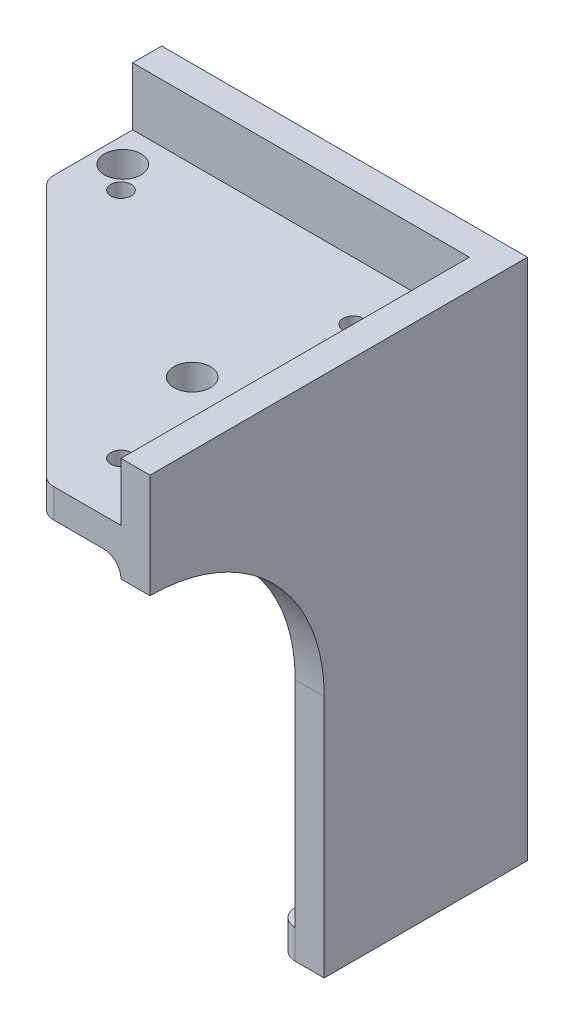
ISO-10303-21;
HEADER;
FILE_DESCRIPTION(('STEP AP214'),'2;1');
FILE_NAME('part.step','',(''),(''),'','','');
FILE_SCHEMA(('AUTOMOTIVE_DESIGN { 1 0 10303 214 1 1 1 1 }'));
ENDSEC;
DATA;
#1=APPLICATION_CONTEXT('core data for automotive mechanical design processes');
#2=APPLICATION_PROTOCOL_DEFINITION('international standard','automotive_design',2000,#1);
#3=PRODUCT_CONTEXT('',#1,'mechanical');
#4=PRODUCT('Part','Part','',(#3));
#5=PRODUCT_RELATED_PRODUCT_CATEGORY('part','',(#4));
#6=PRODUCT_DEFINITION_FORMATION('','',#4);
#7=PRODUCT_DEFINITION_CONTEXT('part definition',#1,'design');
#8=PRODUCT_DEFINITION('design','',#6,#7);
#9=PRODUCT_DEFINITION_SHAPE('','',#8);
#10=(LENGTH_UNIT() NAMED_UNIT(*) SI_UNIT(.MILLI.,.METRE.));
#11=(NAMED_UNIT(*) PLANE_ANGLE_UNIT() SI_UNIT($,.RADIAN.));
#12=(NAMED_UNIT(*) SI_UNIT($,.STERADIAN.) SOLID_ANGLE_UNIT());
#13=UNCERTAINTY_MEASURE_WITH_UNIT(LENGTH_MEASURE(1.E-05),#10,'distance_accuracy_value','');
#14=(GEOMETRIC_REPRESENTATION_CONTEXT(3) GLOBAL_UNCERTAINTY_ASSIGNED_CONTEXT((#13)) GLOBAL_UNIT_ASSIGNED_CONTEXT((#10,
#11,#12)) REPRESENTATION_CONTEXT('',''));
#15=CARTESIAN_POINT('',(0.,0.,0.));
#16=DIRECTION('',(0.,0.,1.));
#17=DIRECTION('',(1.,0.,0.));
#18=AXIS2_PLACEMENT_3D('',#15,#16,#17);
#19=CARTESIAN_POINT('',(-63.,-48.,5.));
#20=DIRECTION('',(0.,0.,1.));
#21=DIRECTION('',(1.,0.,0.));
#22=AXIS2_PLACEMENT_3D('',#19,#20,#21);
#23=PLANE('',#22);
#24=DIRECTION('',(0.,-1.,0.));
#25=VECTOR('',#24,1.);
#26=CARTESIAN_POINT('',(-7.99999999999996,-48.,5.));
#27=LINE('',#26,#25);
#28=CARTESIAN_POINT('',(-7.99999999999996,-85.,5.));
#29=VERTEX_POINT('',#28);
#30=CARTESIAN_POINT('',(-7.99999999999997,-18.,5.));
#31=VERTEX_POINT('',#30);
#32=EDGE_CURVE('E222',#29,#31,#27,.F.);
#33=ORIENTED_EDGE('',*,*,#32,.T.);
#34=DIRECTION('',(1.,0.,0.));
#35=VECTOR('',#34,1.);
#36=CARTESIAN_POINT('',(-63.,-18.,5.));
#37=LINE('',#36,#35);
#38=CARTESIAN_POINT('',(-63.,-18.,5.));
#39=VERTEX_POINT('',#38);
#40=EDGE_CURVE('E223',#31,#39,#37,.F.);
#41=ORIENTED_EDGE('',*,*,#40,.T.);
#42=CARTESIAN_POINT('',(-63.,-48.,5.));
#43=DIRECTION('',(0.,0.,-1.));
#44=DIRECTION('',(1.,0.,0.));
#45=AXIS2_PLACEMENT_3D('',#42,#43,#44);
#46=CIRCLE('',#45,30.);
#47=CARTESIAN_POINT('',(-33.,-48.,5.));
#48=VERTEX_POINT('',#47);
#49=EDGE_CURVE('E380',#39,#48,#46,.T.);
#50=ORIENTED_EDGE('',*,*,#49,.T.);
#51=DIRECTION('',(0.,-1.,0.));
#52=VECTOR('',#51,1.);
#53=CARTESIAN_POINT('',(-33.,-90.,5.));
#54=LINE('',#53,#52);
#55=CARTESIAN_POINT('',(-33.,-85.,5.));
#56=VERTEX_POINT('',#55);
#57=EDGE_CURVE('E382',#48,#56,#54,.T.);
#58=ORIENTED_EDGE('',*,*,#57,.T.);
#59=DIRECTION('',(1.,0.,0.));
#60=VECTOR('',#59,1.);
#61=CARTESIAN_POINT('',(-33.,-85.,5.));
#62=LINE('',#61,#60);
#63=EDGE_CURVE('E268',#56,#29,#62,.T.);
#64=ORIENTED_EDGE('',*,*,#63,.T.);
#65=EDGE_LOOP('',(#33,#41,#50,#58,#64));
#66=FACE_BOUND('',#65,.T.);
#67=ADVANCED_FACE('F33',(#66),#23,.T.);
#68=DIRECTION('',(0.,-1.,0.));
#69=VECTOR('',#68,1.);
#70=CARTESIAN_POINT('',(-63.,-18.,5.));
#71=LINE('',#70,#69);
#72=CARTESIAN_POINT('',(-63.,0.,5.));
#73=VERTEX_POINT('',#72);
#74=CARTESIAN_POINT('',(-63.,-10.,5.));
#75=VERTEX_POINT('',#74);
#76=EDGE_CURVE('E312',#73,#75,#71,.T.);
#77=ORIENTED_EDGE('',*,*,#76,.T.);
#78=DIRECTION('',(-1.,0.,0.));
#79=VECTOR('',#78,1.);
#80=CARTESIAN_POINT('',(-4.99999999999996,-10.,5.));
#81=LINE('',#80,#79);
#82=CARTESIAN_POINT('',(-4.99999999999996,-10.,5.));
#83=VERTEX_POINT('',#82);
#84=EDGE_CURVE('E251',#83,#75,#81,.T.);
#85=ORIENTED_EDGE('',*,*,#84,.F.);
#86=DIRECTION('',(0.,-1.,0.));
#87=VECTOR('',#86,1.);
#88=CARTESIAN_POINT('',(-4.99999999999997,0.,5.));
#89=LINE('',#88,#87);
#90=CARTESIAN_POINT('',(-4.99999999999996,0.,5.));
#91=VERTEX_POINT('',#90);
#92=EDGE_CURVE('E291',#91,#83,#89,.T.);
#93=ORIENTED_EDGE('',*,*,#92,.F.);
#94=DIRECTION('',(-1.,0.,0.));
#95=VECTOR('',#94,1.);
#96=CARTESIAN_POINT('',(-63.,0.,5.));
#97=LINE('',#96,#95);
#98=EDGE_CURVE('E318',#91,#73,#97,.T.);
#99=ORIENTED_EDGE('',*,*,#98,.T.);
#100=EDGE_LOOP('',(#77,#85,#93,#99));
#101=FACE_BOUND('',#100,.T.);
#102=ADVANCED_FACE('F376',(#101),#23,.T.);
#103=CARTESIAN_POINT('',(-4.99999999999997,0.,65.));
#104=DIRECTION('',(1.,0.,0.));
#105=DIRECTION('',(0.,1.,0.));
#106=AXIS2_PLACEMENT_3D('',#103,#104,#105);
#107=PLANE('',#106);
#108=CARTESIAN_POINT('',(-4.99999999999998,-48.,65.));
#109=DIRECTION('',(1.,0.,0.));
#110=DIRECTION('',(0.,1.,0.));
#111=AXIS2_PLACEMENT_3D('',#108,#109,#110);
#112=CIRCLE('',#111,30.);
#113=CARTESIAN_POINT('',(-4.99999999999998,-18.,65.));
#114=VERTEX_POINT('',#113);
#115=CARTESIAN_POINT('',(-4.99999999999997,-48.,35.));
#116=VERTEX_POINT('',#115);
#117=EDGE_CURVE('E288',#114,#116,#112,.F.);
#118=ORIENTED_EDGE('',*,*,#117,.F.);
#119=DIRECTION('',(0.,0.,-1.));
#120=VECTOR('',#119,1.);
#121=CARTESIAN_POINT('',(-4.99999999999997,-18.,5.));
#122=LINE('',#121,#120);
#123=CARTESIAN_POINT('',(-4.99999999999997,-18.,8.));
#124=VERTEX_POINT('',#123);
#125=EDGE_CURVE('E57',#114,#124,#122,.T.);
#126=ORIENTED_EDGE('',*,*,#125,.T.);
#127=DIRECTION('',(0.,-1.,0.));
#128=VECTOR('',#127,1.);
#129=CARTESIAN_POINT('',(-4.99999999999997,0.,8.));
#130=LINE('',#129,#128);
#131=CARTESIAN_POINT('',(-4.99999999999996,-85.,8.));
#132=VERTEX_POINT('',#131);
#133=EDGE_CURVE('E228',#124,#132,#130,.T.);
#134=ORIENTED_EDGE('',*,*,#133,.T.);
#135=DIRECTION('',(0.,0.,1.));
#136=VECTOR('',#135,1.);
#137=CARTESIAN_POINT('',(-4.99999999999996,-85.,5.));
#138=LINE('',#137,#136);
#139=CARTESIAN_POINT('',(-4.99999999999996,-85.,35.));
#140=VERTEX_POINT('',#139);
#141=EDGE_CURVE('E270',#132,#140,#138,.T.);
#142=ORIENTED_EDGE('',*,*,#141,.T.);
#143=DIRECTION('',(0.,-1.,0.));
#144=VECTOR('',#143,1.);
#145=CARTESIAN_POINT('',(-4.99999999999996,-90.,35.));
#146=LINE('',#145,#144);
#147=EDGE_CURVE('E285',#116,#140,#146,.T.);
#148=ORIENTED_EDGE('',*,*,#147,.F.);
#149=EDGE_LOOP('',(#118,#126,#134,#142,#148));
#150=FACE_BOUND('',#149,.T.);
#151=ADVANCED_FACE('F465',(#150),#107,.F.);
#152=DIRECTION('',(0.,0.,-1.));
#153=VECTOR('',#152,1.);
#154=CARTESIAN_POINT('',(-4.99999999999996,-10.,123.215118311312));
#155=LINE('',#154,#153);
#156=CARTESIAN_POINT('',(-4.99999999999996,-10.,65.));
#157=VERTEX_POINT('',#156);
#158=EDGE_CURVE('E265',#157,#83,#155,.T.);
#159=ORIENTED_EDGE('',*,*,#158,.F.);
#160=DIRECTION('',(0.,-1.,0.));
#161=VECTOR('',#160,1.);
#162=CARTESIAN_POINT('',(-4.99999999999997,0.,65.));
#163=LINE('',#162,#161);
#164=CARTESIAN_POINT('',(-4.99999999999997,0.,65.));
#165=VERTEX_POINT('',#164);
#166=EDGE_CURVE('E306',#165,#157,#163,.T.);
#167=ORIENTED_EDGE('',*,*,#166,.F.);
#168=DIRECTION('',(0.,0.,-1.));
#169=VECTOR('',#168,1.);
#170=CARTESIAN_POINT('',(-4.99999999999997,0.,65.));
#171=LINE('',#170,#169);
#172=EDGE_CURVE('E309',#165,#91,#171,.T.);
#173=ORIENTED_EDGE('',*,*,#172,.T.);
#174=ORIENTED_EDGE('',*,*,#92,.T.);
#175=EDGE_LOOP('',(#159,#167,#173,#174));
#176=FACE_BOUND('',#175,.T.);
#177=ADVANCED_FACE('F512',(#176),#107,.F.);
#178=CARTESIAN_POINT('',(-63.,-18.,5.));
#179=DIRECTION('',(1.,0.,0.));
#180=DIRECTION('',(0.,1.,0.));
#181=AXIS2_PLACEMENT_3D('',#178,#179,#180);
#182=PLANE('',#181);
#183=DIRECTION('',(0.,0.,-1.));
#184=VECTOR('',#183,1.);
#185=CARTESIAN_POINT('',(-63.,-15.,123.215118311312));
#186=LINE('',#185,#184);
#187=CARTESIAN_POINT('',(-63.,-15.,18.575));
#188=VERTEX_POINT('',#187);
#189=CARTESIAN_POINT('',(-63.,-15.,8.00000000000004));
#190=VERTEX_POINT('',#189);
#191=EDGE_CURVE('E261',#188,#190,#186,.T.);
#192=ORIENTED_EDGE('',*,*,#191,.F.);
#193=DIRECTION('',(0.,1.,0.));
#194=VECTOR('',#193,1.);
#195=CARTESIAN_POINT('',(-63.,-18.,18.575));
#196=LINE('',#195,#194);
#197=CARTESIAN_POINT('',(-63.,-10.,18.575));
#198=VERTEX_POINT('',#197);
#199=EDGE_CURVE('E219',#188,#198,#196,.T.);
#200=ORIENTED_EDGE('',*,*,#199,.T.);
#201=DIRECTION('',(0.,0.,-1.));
#202=VECTOR('',#201,1.);
#203=CARTESIAN_POINT('',(-63.,-10.,123.215118311312));
#204=LINE('',#203,#202);
#205=EDGE_CURVE('E263',#198,#75,#204,.T.);
#206=ORIENTED_EDGE('',*,*,#205,.T.);
#207=ORIENTED_EDGE('',*,*,#76,.F.);
#208=DIRECTION('',(0.,0.,-1.));
#209=VECTOR('',#208,1.);
#210=CARTESIAN_POINT('',(-63.,0.,5.));
#211=LINE('',#210,#209);
#212=CARTESIAN_POINT('',(-63.,0.,0.));
#213=VERTEX_POINT('',#212);
#214=EDGE_CURVE('E392',#73,#213,#211,.T.);
#215=ORIENTED_EDGE('',*,*,#214,.T.);
#216=DIRECTION('',(0.,-1.,0.));
#217=VECTOR('',#216,1.);
#218=CARTESIAN_POINT('',(-63.,-18.,0.));
#219=LINE('',#218,#217);
#220=CARTESIAN_POINT('',(-63.,-18.,0.));
#221=VERTEX_POINT('',#220);
#222=EDGE_CURVE('E323',#213,#221,#219,.T.);
#223=ORIENTED_EDGE('',*,*,#222,.T.);
#224=DIRECTION('',(0.,0.,-1.));
#225=VECTOR('',#224,1.);
#226=CARTESIAN_POINT('',(-63.,-18.,5.));
#227=LINE('',#226,#225);
#228=EDGE_CURVE('E330',#39,#221,#227,.T.);
#229=ORIENTED_EDGE('',*,*,#228,.F.);
#230=CARTESIAN_POINT('',(-63.,-18.,8.00000000000001));
#231=DIRECTION('',(1.,0.,0.));
#232=DIRECTION('',(0.,1.,0.));
#233=AXIS2_PLACEMENT_3D('',#230,#231,#232);
#234=CIRCLE('',#233,3.);
#235=EDGE_CURVE('E42',#39,#190,#234,.T.);
#236=ORIENTED_EDGE('',*,*,#235,.T.);
#237=EDGE_LOOP('',(#192,#200,#206,#207,#215,#223,#229,#236));
#238=FACE_BOUND('',#237,.T.);
#239=ADVANCED_FACE('F366',(#238),#182,.F.);
#240=CARTESIAN_POINT('',(-63.,-48.,5.));
#241=DIRECTION('',(0.,0.,-1.));
#242=DIRECTION('',(-1.,0.,0.));
#243=AXIS2_PLACEMENT_3D('',#240,#241,#242);
#244=CYLINDRICAL_SURFACE('',#243,30.);
#245=CARTESIAN_POINT('',(-63.,-48.,0.));
#246=DIRECTION('',(0.,0.,-1.));
#247=DIRECTION('',(1.,0.,0.));
#248=AXIS2_PLACEMENT_3D('',#245,#246,#247);
#249=CIRCLE('',#248,30.);
#250=CARTESIAN_POINT('',(-33.,-48.,0.));
#251=VERTEX_POINT('',#250);
#252=EDGE_CURVE('E409',#221,#251,#249,.T.);
#253=ORIENTED_EDGE('',*,*,#252,.T.);
#254=DIRECTION('',(0.,0.,-1.));
#255=VECTOR('',#254,1.);
#256=CARTESIAN_POINT('',(-33.,-48.,5.));
#257=LINE('',#256,#255);
#258=EDGE_CURVE('E400',#48,#251,#257,.T.);
#259=ORIENTED_EDGE('',*,*,#258,.F.);
#260=ORIENTED_EDGE('',*,*,#49,.F.);
#261=ORIENTED_EDGE('',*,*,#228,.T.);
#262=EDGE_LOOP('',(#253,#259,#260,#261));
#263=FACE_BOUND('',#262,.T.);
#264=ADVANCED_FACE('F407',(#263),#244,.F.);
#265=CARTESIAN_POINT('',(-33.,-90.,5.));
#266=DIRECTION('',(1.,0.,0.));
#267=DIRECTION('',(0.,0.,-1.));
#268=AXIS2_PLACEMENT_3D('',#265,#266,#267);
#269=PLANE('',#268);
#270=DIRECTION('',(0.,0.,-1.));
#271=VECTOR('',#270,1.);
#272=CARTESIAN_POINT('',(-33.,-90.,5.));
#273=LINE('',#272,#271);
#274=CARTESIAN_POINT('',(-33.,-90.,5.));
#275=VERTEX_POINT('',#274);
#276=CARTESIAN_POINT('',(-33.,-90.,0.));
#277=VERTEX_POINT('',#276);
#278=EDGE_CURVE('E398',#275,#277,#273,.T.);
#279=ORIENTED_EDGE('',*,*,#278,.F.);
#280=DIRECTION('',(0.,-1.,0.));
#281=VECTOR('',#280,1.);
#282=CARTESIAN_POINT('',(-33.,-85.,5.));
#283=LINE('',#282,#281);
#284=EDGE_CURVE('E334',#275,#56,#283,.F.);
#285=ORIENTED_EDGE('',*,*,#284,.T.);
#286=ORIENTED_EDGE('',*,*,#57,.F.);
#287=ORIENTED_EDGE('',*,*,#258,.T.);
#288=DIRECTION('',(0.,-1.,0.));
#289=VECTOR('',#288,1.);
#290=CARTESIAN_POINT('',(-33.,-90.,0.));
#291=LINE('',#290,#289);
#292=EDGE_CURVE('E413',#251,#277,#291,.T.);
#293=ORIENTED_EDGE('',*,*,#292,.T.);
#294=EDGE_LOOP('',(#279,#285,#286,#287,#293));
#295=FACE_BOUND('',#294,.T.);
#296=ADVANCED_FACE('F504',(#295),#269,.F.);
#297=CARTESIAN_POINT('',(0.,-90.,5.));
#298=DIRECTION('',(0.,1.,0.));
#299=DIRECTION('',(0.,0.,1.));
#300=AXIS2_PLACEMENT_3D('',#297,#298,#299);
#301=PLANE('',#300);
#302=DIRECTION('',(-1.,0.,0.));
#303=VECTOR('',#302,1.);
#304=CARTESIAN_POINT('',(-33.,-90.,8.));
#305=LINE('',#304,#303);
#306=CARTESIAN_POINT('',(-7.99999999999996,-90.,8.));
#307=VERTEX_POINT('',#306);
#308=CARTESIAN_POINT('',(-30.,-90.,8.));
#309=VERTEX_POINT('',#308);
#310=EDGE_CURVE('E271',#307,#309,#305,.T.);
#311=ORIENTED_EDGE('',*,*,#310,.T.);
#312=CARTESIAN_POINT('',(-30.,-90.,5.));
#313=DIRECTION('',(0.,1.,0.));
#314=DIRECTION('',(0.,0.,1.));
#315=AXIS2_PLACEMENT_3D('',#312,#313,#314);
#316=CIRCLE('',#315,3.);
#317=EDGE_CURVE('E332',#309,#275,#316,.F.);
#318=ORIENTED_EDGE('',*,*,#317,.T.);
#319=ORIENTED_EDGE('',*,*,#278,.T.);
#320=DIRECTION('',(1.,0.,0.));
#321=VECTOR('',#320,1.);
#322=CARTESIAN_POINT('',(0.,-90.,0.));
#323=LINE('',#322,#321);
#324=CARTESIAN_POINT('',(0.,-90.,0.));
#325=VERTEX_POINT('',#324);
#326=EDGE_CURVE('E388',#277,#325,#323,.T.);
#327=ORIENTED_EDGE('',*,*,#326,.T.);
#328=DIRECTION('',(0.,0.,-1.));
#329=VECTOR('',#328,1.);
#330=CARTESIAN_POINT('',(0.,-90.,5.));
#331=LINE('',#330,#329);
#332=CARTESIAN_POINT('',(0.,-90.,35.));
#333=VERTEX_POINT('',#332);
#334=EDGE_CURVE('E396',#333,#325,#331,.T.);
#335=ORIENTED_EDGE('',*,*,#334,.F.);
#336=DIRECTION('',(1.,0.,0.));
#337=VECTOR('',#336,1.);
#338=CARTESIAN_POINT('',(-82.9999999999999,-90.,35.));
#339=LINE('',#338,#337);
#340=CARTESIAN_POINT('',(-4.99999999999996,-90.,35.));
#341=VERTEX_POINT('',#340);
#342=EDGE_CURVE('E296',#341,#333,#339,.T.);
#343=ORIENTED_EDGE('',*,*,#342,.F.);
#344=CARTESIAN_POINT('',(-4.99999999999996,-90.,32.));
#345=DIRECTION('',(0.,1.,0.));
#346=DIRECTION('',(0.,0.,1.));
#347=AXIS2_PLACEMENT_3D('',#344,#345,#346);
#348=CIRCLE('',#347,3.);
#349=CARTESIAN_POINT('',(-7.99999999999996,-90.,32.));
#350=VERTEX_POINT('',#349);
#351=EDGE_CURVE('E329',#341,#350,#348,.F.);
#352=ORIENTED_EDGE('',*,*,#351,.T.);
#353=DIRECTION('',(0.,0.,-1.));
#354=VECTOR('',#353,1.);
#355=CARTESIAN_POINT('',(-7.99999999999996,-90.,8.));
#356=LINE('',#355,#354);
#357=EDGE_CURVE('E257',#350,#307,#356,.T.);
#358=ORIENTED_EDGE('',*,*,#357,.T.);
#359=EDGE_LOOP('',(#311,#318,#319,#327,#335,#343,#352,#358));
#360=FACE_BOUND('',#359,.T.);
#361=ADVANCED_FACE('F424',(#360),#301,.F.);
#362=CARTESIAN_POINT('',(0.,0.,5.));
#363=DIRECTION('',(-1.,0.,0.));
#364=DIRECTION('',(0.,-1.,0.));
#365=AXIS2_PLACEMENT_3D('',#362,#363,#364);
#366=PLANE('',#365);
#367=DIRECTION('',(0.,1.,0.));
#368=VECTOR('',#367,1.);
#369=CARTESIAN_POINT('',(0.,0.,65.));
#370=LINE('',#369,#368);
#371=CARTESIAN_POINT('',(0.,-18.,65.));
#372=VERTEX_POINT('',#371);
#373=CARTESIAN_POINT('',(0.,0.,65.));
#374=VERTEX_POINT('',#373);
#375=EDGE_CURVE('E302',#372,#374,#370,.T.);
#376=ORIENTED_EDGE('',*,*,#375,.F.);
#377=CARTESIAN_POINT('',(0.,-48.,65.));
#378=DIRECTION('',(1.,0.,0.));
#379=DIRECTION('',(0.,1.,0.));
#380=AXIS2_PLACEMENT_3D('',#377,#378,#379);
#381=CIRCLE('',#380,30.);
#382=CARTESIAN_POINT('',(0.,-48.,35.));
#383=VERTEX_POINT('',#382);
#384=EDGE_CURVE('E294',#383,#372,#381,.T.);
#385=ORIENTED_EDGE('',*,*,#384,.F.);
#386=DIRECTION('',(0.,1.,0.));
#387=VECTOR('',#386,1.);
#388=CARTESIAN_POINT('',(0.,-90.,35.));
#389=LINE('',#388,#387);
#390=EDGE_CURVE('E284',#333,#383,#389,.T.);
#391=ORIENTED_EDGE('',*,*,#390,.F.);
#392=ORIENTED_EDGE('',*,*,#334,.T.);
#393=DIRECTION('',(0.,1.,0.));
#394=VECTOR('',#393,1.);
#395=CARTESIAN_POINT('',(0.,0.,0.));
#396=LINE('',#395,#394);
#397=CARTESIAN_POINT('',(0.,0.,0.));
#398=VERTEX_POINT('',#397);
#399=EDGE_CURVE('E383',#325,#398,#396,.T.);
#400=ORIENTED_EDGE('',*,*,#399,.T.);
#401=DIRECTION('',(0.,0.,-1.));
#402=VECTOR('',#401,1.);
#403=CARTESIAN_POINT('',(0.,0.,5.));
#404=LINE('',#403,#402);
#405=EDGE_CURVE('E394',#374,#398,#404,.T.);
#406=ORIENTED_EDGE('',*,*,#405,.F.);
#407=EDGE_LOOP('',(#376,#385,#391,#392,#400,#406));
#408=FACE_BOUND('',#407,.T.);
#409=ADVANCED_FACE('F432',(#408),#366,.F.);
#410=CARTESIAN_POINT('',(-63.,0.,5.));
#411=DIRECTION('',(0.,-1.,0.));
#412=DIRECTION('',(0.,0.,-1.));
#413=AXIS2_PLACEMENT_3D('',#410,#411,#412);
#414=PLANE('',#413);
#415=DIRECTION('',(-1.,0.,0.));
#416=VECTOR('',#415,1.);
#417=CARTESIAN_POINT('',(-63.,0.,0.));
#418=LINE('',#417,#416);
#419=EDGE_CURVE('E381',#398,#213,#418,.T.);
#420=ORIENTED_EDGE('',*,*,#419,.T.);
#421=ORIENTED_EDGE('',*,*,#214,.F.);
#422=ORIENTED_EDGE('',*,*,#98,.F.);
#423=ORIENTED_EDGE('',*,*,#172,.F.);
#424=DIRECTION('',(-1.,0.,0.));
#425=VECTOR('',#424,1.);
#426=CARTESIAN_POINT('',(0.,0.,65.));
#427=LINE('',#426,#425);
#428=EDGE_CURVE('E304',#374,#165,#427,.T.);
#429=ORIENTED_EDGE('',*,*,#428,.F.);
#430=ORIENTED_EDGE('',*,*,#405,.T.);
#431=EDGE_LOOP('',(#420,#421,#422,#423,#429,#430));
#432=FACE_BOUND('',#431,.T.);
#433=ADVANCED_FACE('F435',(#432),#414,.F.);
#434=CARTESIAN_POINT('',(-63.,-48.,0.));
#435=DIRECTION('',(0.,0.,1.));
#436=DIRECTION('',(1.,0.,0.));
#437=AXIS2_PLACEMENT_3D('',#434,#435,#436);
#438=PLANE('',#437);
#439=ORIENTED_EDGE('',*,*,#222,.F.);
#440=ORIENTED_EDGE('',*,*,#419,.F.);
#441=ORIENTED_EDGE('',*,*,#399,.F.);
#442=ORIENTED_EDGE('',*,*,#326,.F.);
#443=ORIENTED_EDGE('',*,*,#292,.F.);
#444=ORIENTED_EDGE('',*,*,#252,.F.);
#445=EDGE_LOOP('',(#439,#440,#441,#442,#443,#444));
#446=FACE_BOUND('',#445,.T.);
#447=ADVANCED_FACE('F428',(#446),#438,.F.);
#448=CARTESIAN_POINT('',(0.,0.,65.));
#449=DIRECTION('',(0.,0.,-1.));
#450=DIRECTION('',(-1.,0.,0.));
#451=AXIS2_PLACEMENT_3D('',#448,#449,#450);
#452=PLANE('',#451);
#453=DIRECTION('',(1.,0.,0.));
#454=VECTOR('',#453,1.);
#455=CARTESIAN_POINT('',(-4.99999999999996,-10.,65.));
#456=LINE('',#455,#454);
#457=CARTESIAN_POINT('',(-16.5750000000004,-10.,65.));
#458=VERTEX_POINT('',#457);
#459=EDGE_CURVE('E255',#458,#157,#456,.T.);
#460=ORIENTED_EDGE('',*,*,#459,.F.);
#461=DIRECTION('',(0.,1.,0.));
#462=VECTOR('',#461,1.);
#463=CARTESIAN_POINT('',(-16.5750000000004,0.,65.));
#464=LINE('',#463,#462);
#465=CARTESIAN_POINT('',(-16.5750000000004,-15.,65.));
#466=VERTEX_POINT('',#465);
#467=EDGE_CURVE('E354',#458,#466,#464,.F.);
#468=ORIENTED_EDGE('',*,*,#467,.T.);
#469=DIRECTION('',(-1.,0.,0.));
#470=VECTOR('',#469,1.);
#471=CARTESIAN_POINT('',(-4.99999999999996,-15.,65.));
#472=LINE('',#471,#470);
#473=CARTESIAN_POINT('',(-7.99999999999997,-15.,65.));
#474=VERTEX_POINT('',#473);
#475=EDGE_CURVE('E258',#474,#466,#472,.T.);
#476=ORIENTED_EDGE('',*,*,#475,.F.);
#477=CARTESIAN_POINT('',(-7.99999999999997,-18.,65.));
#478=DIRECTION('',(0.,0.,-1.));
#479=DIRECTION('',(-1.,0.,0.));
#480=AXIS2_PLACEMENT_3D('',#477,#478,#479);
#481=CIRCLE('',#480,3.);
#482=EDGE_CURVE('E11',#474,#114,#481,.T.);
#483=ORIENTED_EDGE('',*,*,#482,.T.);
#484=DIRECTION('',(1.,0.,0.));
#485=VECTOR('',#484,1.);
#486=CARTESIAN_POINT('',(-83.,-18.,65.));
#487=LINE('',#486,#485);
#488=EDGE_CURVE('E289',#114,#372,#487,.T.);
#489=ORIENTED_EDGE('',*,*,#488,.T.);
#490=ORIENTED_EDGE('',*,*,#375,.T.);
#491=ORIENTED_EDGE('',*,*,#428,.T.);
#492=ORIENTED_EDGE('',*,*,#166,.T.);
#493=EDGE_LOOP('',(#460,#468,#476,#483,#489,#490,#491,#492));
#494=FACE_BOUND('',#493,.T.);
#495=ADVANCED_FACE('F440',(#494),#452,.F.);
#496=CARTESIAN_POINT('',(-82.9999999999999,-48.,65.));
#497=DIRECTION('',(1.,0.,0.));
#498=DIRECTION('',(0.,1.,0.));
#499=AXIS2_PLACEMENT_3D('',#496,#497,#498);
#500=CYLINDRICAL_SURFACE('',#499,30.);
#501=ORIENTED_EDGE('',*,*,#117,.T.);
#502=DIRECTION('',(1.,0.,0.));
#503=VECTOR('',#502,1.);
#504=CARTESIAN_POINT('',(-82.9999999999999,-48.,35.));
#505=LINE('',#504,#503);
#506=EDGE_CURVE('E299',#116,#383,#505,.T.);
#507=ORIENTED_EDGE('',*,*,#506,.T.);
#508=ORIENTED_EDGE('',*,*,#384,.T.);
#509=ORIENTED_EDGE('',*,*,#488,.F.);
#510=EDGE_LOOP('',(#501,#507,#508,#509));
#511=FACE_BOUND('',#510,.T.);
#512=ADVANCED_FACE('F444',(#511),#500,.F.);
#513=CARTESIAN_POINT('',(-82.9999999999999,-90.,35.));
#514=DIRECTION('',(0.,0.,-1.));
#515=DIRECTION('',(0.,1.,0.));
#516=AXIS2_PLACEMENT_3D('',#513,#514,#515);
#517=PLANE('',#516);
#518=ORIENTED_EDGE('',*,*,#147,.T.);
#519=DIRECTION('',(0.,-1.,0.));
#520=VECTOR('',#519,1.);
#521=CARTESIAN_POINT('',(-4.99999999999996,-90.,35.));
#522=LINE('',#521,#520);
#523=EDGE_CURVE('E341',#140,#341,#522,.T.);
#524=ORIENTED_EDGE('',*,*,#523,.T.);
#525=ORIENTED_EDGE('',*,*,#342,.T.);
#526=ORIENTED_EDGE('',*,*,#390,.T.);
#527=ORIENTED_EDGE('',*,*,#506,.F.);
#528=EDGE_LOOP('',(#518,#524,#525,#526,#527));
#529=FACE_BOUND('',#528,.T.);
#530=ADVANCED_FACE('F448',(#529),#517,.F.);
#531=CARTESIAN_POINT('',(-33.,-85.,8.));
#532=DIRECTION('',(0.,0.,1.));
#533=DIRECTION('',(1.,0.,0.));
#534=AXIS2_PLACEMENT_3D('',#531,#532,#533);
#535=PLANE('',#534);
#536=DIRECTION('',(-1.,0.,0.));
#537=VECTOR('',#536,1.);
#538=CARTESIAN_POINT('',(-33.,-85.,8.));
#539=LINE('',#538,#537);
#540=CARTESIAN_POINT('',(-7.99999999999996,-85.,8.));
#541=VERTEX_POINT('',#540);
#542=CARTESIAN_POINT('',(-30.,-85.,8.));
#543=VERTEX_POINT('',#542);
#544=EDGE_CURVE('E275',#541,#543,#539,.T.);
#545=ORIENTED_EDGE('',*,*,#544,.T.);
#546=DIRECTION('',(0.,-1.,0.));
#547=VECTOR('',#546,1.);
#548=CARTESIAN_POINT('',(-30.,-90.,8.));
#549=LINE('',#548,#547);
#550=EDGE_CURVE('E326',#543,#309,#549,.T.);
#551=ORIENTED_EDGE('',*,*,#550,.T.);
#552=ORIENTED_EDGE('',*,*,#310,.F.);
#553=DIRECTION('',(0.,-1.,0.));
#554=VECTOR('',#553,1.);
#555=CARTESIAN_POINT('',(-7.99999999999996,-85.,8.));
#556=LINE('',#555,#554);
#557=EDGE_CURVE('E278',#541,#307,#556,.T.);
#558=ORIENTED_EDGE('',*,*,#557,.F.);
#559=EDGE_LOOP('',(#545,#551,#552,#558));
#560=FACE_BOUND('',#559,.T.);
#561=ADVANCED_FACE('F628',(#560),#535,.T.);
#562=CARTESIAN_POINT('',(-7.99999999999996,-85.,8.));
#563=DIRECTION('',(-1.,0.,0.));
#564=DIRECTION('',(0.,-1.,0.));
#565=AXIS2_PLACEMENT_3D('',#562,#563,#564);
#566=PLANE('',#565);
#567=ORIENTED_EDGE('',*,*,#357,.F.);
#568=DIRECTION('',(0.,-1.,0.));
#569=VECTOR('',#568,1.);
#570=CARTESIAN_POINT('',(-7.99999999999996,-85.,32.));
#571=LINE('',#570,#569);
#572=CARTESIAN_POINT('',(-7.99999999999996,-85.,32.));
#573=VERTEX_POINT('',#572);
#574=EDGE_CURVE('E344',#350,#573,#571,.F.);
#575=ORIENTED_EDGE('',*,*,#574,.T.);
#576=DIRECTION('',(0.,0.,-1.));
#577=VECTOR('',#576,1.);
#578=CARTESIAN_POINT('',(-7.99999999999996,-85.,8.));
#579=LINE('',#578,#577);
#580=EDGE_CURVE('E273',#573,#541,#579,.T.);
#581=ORIENTED_EDGE('',*,*,#580,.T.);
#582=ORIENTED_EDGE('',*,*,#557,.T.);
#583=EDGE_LOOP('',(#567,#575,#581,#582));
#584=FACE_BOUND('',#583,.T.);
#585=ADVANCED_FACE('F454',(#584),#566,.T.);
#586=CARTESIAN_POINT('',(0.,-85.,0.));
#587=DIRECTION('',(0.,1.,0.));
#588=DIRECTION('',(0.,0.,1.));
#589=AXIS2_PLACEMENT_3D('',#586,#587,#588);
#590=PLANE('',#589);
#591=ORIENTED_EDGE('',*,*,#141,.F.);
#592=CARTESIAN_POINT('',(-7.99999999999996,-85.,8.));
#593=DIRECTION('',(0.,1.,0.));
#594=DIRECTION('',(0.,0.,1.));
#595=AXIS2_PLACEMENT_3D('',#592,#593,#594);
#596=CIRCLE('',#595,3.);
#597=EDGE_CURVE('E233',#132,#29,#596,.T.);
#598=ORIENTED_EDGE('',*,*,#597,.T.);
#599=ORIENTED_EDGE('',*,*,#63,.F.);
#600=CARTESIAN_POINT('',(-30.,-85.,5.));
#601=DIRECTION('',(0.,1.,0.));
#602=DIRECTION('',(0.,0.,1.));
#603=AXIS2_PLACEMENT_3D('',#600,#601,#602);
#604=CIRCLE('',#603,3.);
#605=EDGE_CURVE('E339',#56,#543,#604,.T.);
#606=ORIENTED_EDGE('',*,*,#605,.T.);
#607=ORIENTED_EDGE('',*,*,#544,.F.);
#608=ORIENTED_EDGE('',*,*,#580,.F.);
#609=CARTESIAN_POINT('',(-4.99999999999996,-85.,32.));
#610=DIRECTION('',(0.,1.,0.));
#611=DIRECTION('',(0.,0.,1.));
#612=AXIS2_PLACEMENT_3D('',#609,#610,#611);
#613=CIRCLE('',#612,3.);
#614=EDGE_CURVE('E336',#573,#140,#613,.T.);
#615=ORIENTED_EDGE('',*,*,#614,.T.);
#616=EDGE_LOOP('',(#591,#598,#599,#606,#607,#608,#615));
#617=FACE_BOUND('',#616,.T.);
#618=ADVANCED_FACE('F462',(#617),#590,.T.);
#619=CARTESIAN_POINT('',(-30.,-85.,5.));
#620=DIRECTION('',(0.,1.,0.));
#621=DIRECTION('',(0.,0.,1.));
#622=AXIS2_PLACEMENT_3D('',#619,#620,#621);
#623=CYLINDRICAL_SURFACE('',#622,3.);
#624=ORIENTED_EDGE('',*,*,#605,.F.);
#625=ORIENTED_EDGE('',*,*,#284,.F.);
#626=ORIENTED_EDGE('',*,*,#317,.F.);
#627=ORIENTED_EDGE('',*,*,#550,.F.);
#628=EDGE_LOOP('',(#624,#625,#626,#627));
#629=FACE_BOUND('',#628,.T.);
#630=ADVANCED_FACE('F513',(#629),#623,.T.);
#631=CARTESIAN_POINT('',(-4.99999999999996,-90.,32.));
#632=DIRECTION('',(0.,1.,0.));
#633=DIRECTION('',(0.,0.,1.));
#634=AXIS2_PLACEMENT_3D('',#631,#632,#633);
#635=CYLINDRICAL_SURFACE('',#634,3.);
#636=ORIENTED_EDGE('',*,*,#614,.F.);
#637=ORIENTED_EDGE('',*,*,#574,.F.);
#638=ORIENTED_EDGE('',*,*,#351,.F.);
#639=ORIENTED_EDGE('',*,*,#523,.F.);
#640=EDGE_LOOP('',(#636,#637,#638,#639));
#641=FACE_BOUND('',#640,.T.);
#642=ADVANCED_FACE('F459',(#641),#635,.T.);
#643=CARTESIAN_POINT('',(-4.99999999999996,-15.,123.215118311312));
#644=DIRECTION('',(0.,1.,0.));
#645=DIRECTION('',(-1.,0.,0.));
#646=AXIS2_PLACEMENT_3D('',#643,#644,#645);
#647=PLANE('',#646);
#648=CARTESIAN_POINT('',(-20.97500000001,-15.,36.755655034));
#649=DIRECTION('',(0.,1.,0.));
#650=DIRECTION('',(-1.,0.,0.));
#651=AXIS2_PLACEMENT_3D('',#648,#649,#650);
#652=CIRCLE('',#651,3.15);
#653=CARTESIAN_POINT('',(-24.12500000001,-15.,36.755655034));
#654=VERTEX_POINT('',#653);
#655=EDGE_CURVE('E799',#654,#654,#652,.F.);
#656=ORIENTED_EDGE('',*,*,#655,.F.);
#657=EDGE_LOOP('',(#656));
#658=FACE_BOUND('',#657,.T.);
#659=CARTESIAN_POINT('',(-55.,-15.,15.));
#660=DIRECTION('',(0.,1.,0.));
#661=DIRECTION('',(-1.,0.,0.));
#662=AXIS2_PLACEMENT_3D('',#659,#660,#661);
#663=CIRCLE('',#662,1.75);
#664=CARTESIAN_POINT('',(-56.75,-15.,15.));
#665=VERTEX_POINT('',#664);
#666=EDGE_CURVE('E810',#665,#665,#663,.F.);
#667=ORIENTED_EDGE('',*,*,#666,.F.);
#668=EDGE_LOOP('',(#667));
#669=FACE_BOUND('',#668,.T.);
#670=CARTESIAN_POINT('',(-15.,-15.,15.));
#671=DIRECTION('',(0.,1.,0.));
#672=DIRECTION('',(-1.,0.,0.));
#673=AXIS2_PLACEMENT_3D('',#670,#671,#672);
#674=CIRCLE('',#673,1.75);
#675=CARTESIAN_POINT('',(-16.75,-15.,15.));
#676=VERTEX_POINT('',#675);
#677=EDGE_CURVE('E816',#676,#676,#674,.F.);
#678=ORIENTED_EDGE('',*,*,#677,.F.);
#679=EDGE_LOOP('',(#678));
#680=FACE_BOUND('',#679,.T.);
#681=CARTESIAN_POINT('',(-15.,-15.,55.));
#682=DIRECTION('',(0.,1.,0.));
#683=DIRECTION('',(-1.,0.,0.));
#684=AXIS2_PLACEMENT_3D('',#681,#682,#683);
#685=CIRCLE('',#684,1.75);
#686=CARTESIAN_POINT('',(-16.75,-15.,55.));
#687=VERTEX_POINT('',#686);
#688=EDGE_CURVE('E237',#687,#687,#685,.F.);
#689=ORIENTED_EDGE('',*,*,#688,.F.);
#690=EDGE_LOOP('',(#689));
#691=FACE_BOUND('',#690,.T.);
#692=DIRECTION('',(1.,0.,0.));
#693=VECTOR('',#692,1.);
#694=CARTESIAN_POINT('',(-4.99999999999996,-15.,8.00000000000001));
#695=LINE('',#694,#693);
#696=CARTESIAN_POINT('',(-59.6604448215249,-15.,8.00000000000001));
#697=VERTEX_POINT('',#696);
#698=EDGE_CURVE('E197',#190,#697,#695,.T.);
#699=ORIENTED_EDGE('',*,*,#698,.T.);
#700=CARTESIAN_POINT('',(-58.69997618591,-15.,11.));
#701=DIRECTION('',(0.,1.,0.));
#702=DIRECTION('',(-1.,0.,0.));
#703=AXIS2_PLACEMENT_3D('',#700,#701,#702);
#704=CIRCLE('',#703,3.15);
#705=CARTESIAN_POINT('',(-57.7395075502951,-15.,8.00000000000001));
#706=VERTEX_POINT('',#705);
#707=EDGE_CURVE('E204',#706,#697,#704,.F.);
#708=ORIENTED_EDGE('',*,*,#707,.F.);
#709=CARTESIAN_POINT('',(-7.99999999999997,-15.,8.00000000000001));
#710=VERTEX_POINT('',#709);
#711=EDGE_CURVE('E198',#706,#710,#695,.T.);
#712=ORIENTED_EDGE('',*,*,#711,.T.);
#713=DIRECTION('',(0.,0.,-1.));
#714=VECTOR('',#713,1.);
#715=CARTESIAN_POINT('',(-7.99999999999997,-15.,65.));
#716=LINE('',#715,#714);
#717=EDGE_CURVE('E218',#710,#474,#716,.F.);
#718=ORIENTED_EDGE('',*,*,#717,.T.);
#719=ORIENTED_EDGE('',*,*,#475,.T.);
#720=CARTESIAN_POINT('',(-16.5750000000004,-15.,62.));
#721=DIRECTION('',(0.,1.,0.));
#722=DIRECTION('',(-1.,0.,0.));
#723=AXIS2_PLACEMENT_3D('',#720,#721,#722);
#724=CIRCLE('',#723,3.);
#725=CARTESIAN_POINT('',(-18.6963203435601,-15.,64.1213203435597));
#726=VERTEX_POINT('',#725);
#727=EDGE_CURVE('E359',#466,#726,#724,.F.);
#728=ORIENTED_EDGE('',*,*,#727,.T.);
#729=DIRECTION('',(0.707106781186544,0.,0.707106781186551));
#730=VECTOR('',#729,1.);
#731=CARTESIAN_POINT('',(-63.,-15.,19.8176406871193));
#732=LINE('',#731,#730);
#733=CARTESIAN_POINT('',(-62.1213203435597,-15.,20.6963203435596));
#734=VERTEX_POINT('',#733);
#735=EDGE_CURVE('E244',#734,#726,#732,.T.);
#736=ORIENTED_EDGE('',*,*,#735,.F.);
#737=CARTESIAN_POINT('',(-60.,-15.,18.575));
#738=DIRECTION('',(0.,1.,0.));
#739=DIRECTION('',(-1.,0.,0.));
#740=AXIS2_PLACEMENT_3D('',#737,#738,#739);
#741=CIRCLE('',#740,3.);
#742=EDGE_CURVE('E357',#734,#188,#741,.F.);
#743=ORIENTED_EDGE('',*,*,#742,.T.);
#744=ORIENTED_EDGE('',*,*,#191,.T.);
#745=EDGE_LOOP('',(#699,#708,#712,#718,#719,#728,#736,#743,#744));
#746=FACE_BOUND('',#745,.T.);
#747=ADVANCED_FACE('F208',(#658,#669,#680,#691,#746),#647,.F.);
#748=CARTESIAN_POINT('',(-4.99999999999996,-10.,123.215118311312));
#749=DIRECTION('',(0.,-1.,0.));
#750=DIRECTION('',(1.,0.,0.));
#751=AXIS2_PLACEMENT_3D('',#748,#749,#750);
#752=PLANE('',#751);
#753=CARTESIAN_POINT('',(-20.97500000001,-10.,36.755655034));
#754=DIRECTION('',(0.,1.,0.));
#755=DIRECTION('',(-1.,0.,0.));
#756=AXIS2_PLACEMENT_3D('',#753,#754,#755);
#757=CIRCLE('',#756,3.15);
#758=CARTESIAN_POINT('',(-24.12500000001,-10.,36.755655034));
#759=VERTEX_POINT('',#758);
#760=EDGE_CURVE('E802',#759,#759,#757,.T.);
#761=ORIENTED_EDGE('',*,*,#760,.F.);
#762=EDGE_LOOP('',(#761));
#763=FACE_BOUND('',#762,.T.);
#764=CARTESIAN_POINT('',(-58.69997618591,-10.,11.));
#765=DIRECTION('',(0.,1.,0.));
#766=DIRECTION('',(-1.,0.,0.));
#767=AXIS2_PLACEMENT_3D('',#764,#765,#766);
#768=CIRCLE('',#767,3.15);
#769=CARTESIAN_POINT('',(-61.84997618591,-10.,11.));
#770=VERTEX_POINT('',#769);
#771=EDGE_CURVE('E211',#770,#770,#768,.T.);
#772=ORIENTED_EDGE('',*,*,#771,.F.);
#773=EDGE_LOOP('',(#772));
#774=FACE_BOUND('',#773,.T.);
#775=CARTESIAN_POINT('',(-55.,-10.,15.));
#776=DIRECTION('',(0.,1.,0.));
#777=DIRECTION('',(-1.,0.,0.));
#778=AXIS2_PLACEMENT_3D('',#775,#776,#777);
#779=CIRCLE('',#778,1.75);
#780=CARTESIAN_POINT('',(-56.75,-10.,15.));
#781=VERTEX_POINT('',#780);
#782=EDGE_CURVE('E205',#781,#781,#779,.T.);
#783=ORIENTED_EDGE('',*,*,#782,.F.);
#784=EDGE_LOOP('',(#783));
#785=FACE_BOUND('',#784,.T.);
#786=CARTESIAN_POINT('',(-15.,-10.,15.));
#787=DIRECTION('',(0.,1.,0.));
#788=DIRECTION('',(-1.,0.,0.));
#789=AXIS2_PLACEMENT_3D('',#786,#787,#788);
#790=CIRCLE('',#789,1.75);
#791=CARTESIAN_POINT('',(-16.75,-10.,15.));
#792=VERTEX_POINT('',#791);
#793=EDGE_CURVE('E813',#792,#792,#790,.T.);
#794=ORIENTED_EDGE('',*,*,#793,.F.);
#795=EDGE_LOOP('',(#794));
#796=FACE_BOUND('',#795,.T.);
#797=CARTESIAN_POINT('',(-15.,-10.,55.));
#798=DIRECTION('',(0.,1.,0.));
#799=DIRECTION('',(-1.,0.,0.));
#800=AXIS2_PLACEMENT_3D('',#797,#798,#799);
#801=CIRCLE('',#800,1.75);
#802=CARTESIAN_POINT('',(-16.75,-10.,55.));
#803=VERTEX_POINT('',#802);
#804=EDGE_CURVE('E819',#803,#803,#801,.T.);
#805=ORIENTED_EDGE('',*,*,#804,.F.);
#806=EDGE_LOOP('',(#805));
#807=FACE_BOUND('',#806,.T.);
#808=DIRECTION('',(-0.707106781186544,0.,-0.707106781186551));
#809=VECTOR('',#808,1.);
#810=CARTESIAN_POINT('',(-63.,-10.,19.8176406871193));
#811=LINE('',#810,#809);
#812=CARTESIAN_POINT('',(-18.6963203435601,-10.,64.1213203435596));
#813=VERTEX_POINT('',#812);
#814=CARTESIAN_POINT('',(-62.1213203435597,-10.,20.6963203435596));
#815=VERTEX_POINT('',#814);
#816=EDGE_CURVE('E240',#813,#815,#811,.T.);
#817=ORIENTED_EDGE('',*,*,#816,.F.);
#818=CARTESIAN_POINT('',(-16.5750000000004,-9.99999999999999,62.));
#819=DIRECTION('',(0.,-1.,0.));
#820=DIRECTION('',(1.,0.,0.));
#821=AXIS2_PLACEMENT_3D('',#818,#819,#820);
#822=CIRCLE('',#821,3.);
#823=EDGE_CURVE('E352',#813,#458,#822,.F.);
#824=ORIENTED_EDGE('',*,*,#823,.T.);
#825=ORIENTED_EDGE('',*,*,#459,.T.);
#826=ORIENTED_EDGE('',*,*,#158,.T.);
#827=ORIENTED_EDGE('',*,*,#84,.T.);
#828=ORIENTED_EDGE('',*,*,#205,.F.);
#829=CARTESIAN_POINT('',(-60.,-10.,18.575));
#830=DIRECTION('',(0.,-1.,0.));
#831=DIRECTION('',(1.,0.,0.));
#832=AXIS2_PLACEMENT_3D('',#829,#830,#831);
#833=CIRCLE('',#832,3.);
#834=EDGE_CURVE('E350',#198,#815,#833,.F.);
#835=ORIENTED_EDGE('',*,*,#834,.T.);
#836=EDGE_LOOP('',(#817,#824,#825,#826,#827,#828,#835));
#837=FACE_BOUND('',#836,.T.);
#838=ADVANCED_FACE('F371',(#763,#774,#785,#796,#807,#837),#752,.F.);
#839=CARTESIAN_POINT('',(-63.,-78.8975053202899,19.8176406871193));
#840=DIRECTION('',(0.707106781186551,0.,-0.707106781186544));
#841=DIRECTION('',(-0.707106781186544,0.,-0.707106781186551));
#842=AXIS2_PLACEMENT_3D('',#839,#840,#841);
#843=PLANE('',#842);
#844=ORIENTED_EDGE('',*,*,#735,.T.);
#845=DIRECTION('',(0.,1.,0.));
#846=VECTOR('',#845,1.);
#847=CARTESIAN_POINT('',(-18.6963203435601,-78.8975053202899,64.1213203435596));
#848=LINE('',#847,#846);
#849=EDGE_CURVE('E348',#726,#813,#848,.T.);
#850=ORIENTED_EDGE('',*,*,#849,.T.);
#851=ORIENTED_EDGE('',*,*,#816,.T.);
#852=DIRECTION('',(0.,1.,0.));
#853=VECTOR('',#852,1.);
#854=CARTESIAN_POINT('',(-62.1213203435596,-78.8975053202899,20.6963203435597));
#855=LINE('',#854,#853);
#856=EDGE_CURVE('E346',#815,#734,#855,.F.);
#857=ORIENTED_EDGE('',*,*,#856,.T.);
#858=EDGE_LOOP('',(#844,#850,#851,#857));
#859=FACE_BOUND('',#858,.T.);
#860=ADVANCED_FACE('F477',(#859),#843,.F.);
#861=CARTESIAN_POINT('',(-16.5750000000004,-78.8975053202899,62.));
#862=DIRECTION('',(0.,1.,0.));
#863=DIRECTION('',(-1.,0.,0.));
#864=AXIS2_PLACEMENT_3D('',#861,#862,#863);
#865=CYLINDRICAL_SURFACE('',#864,3.);
#866=ORIENTED_EDGE('',*,*,#727,.F.);
#867=ORIENTED_EDGE('',*,*,#467,.F.);
#868=ORIENTED_EDGE('',*,*,#823,.F.);
#869=ORIENTED_EDGE('',*,*,#849,.F.);
#870=EDGE_LOOP('',(#866,#867,#868,#869));
#871=FACE_BOUND('',#870,.T.);
#872=ADVANCED_FACE('F475',(#871),#865,.T.);
#873=CARTESIAN_POINT('',(-60.,-18.,18.575));
#874=DIRECTION('',(0.,1.,0.));
#875=DIRECTION('',(-1.,0.,0.));
#876=AXIS2_PLACEMENT_3D('',#873,#874,#875);
#877=CYLINDRICAL_SURFACE('',#876,3.);
#878=ORIENTED_EDGE('',*,*,#742,.F.);
#879=ORIENTED_EDGE('',*,*,#856,.F.);
#880=ORIENTED_EDGE('',*,*,#834,.F.);
#881=ORIENTED_EDGE('',*,*,#199,.F.);
#882=EDGE_LOOP('',(#878,#879,#880,#881));
#883=FACE_BOUND('',#882,.T.);
#884=ADVANCED_FACE('F478',(#883),#877,.T.);
#885=CARTESIAN_POINT('',(-7.99999999999997,-18.,65.));
#886=DIRECTION('',(0.,0.,1.));
#887=DIRECTION('',(1.,0.,0.));
#888=AXIS2_PLACEMENT_3D('',#885,#886,#887);
#889=CYLINDRICAL_SURFACE('',#888,3.);
#890=ORIENTED_EDGE('',*,*,#482,.F.);
#891=ORIENTED_EDGE('',*,*,#717,.F.);
#892=CARTESIAN_POINT('',(-7.99999999999997,-18.,8.));
#893=DIRECTION('',(0.,0.,1.));
#894=DIRECTION('',(0.,-1.,0.));
#895=AXIS2_PLACEMENT_3D('',#892,#893,#894);
#896=CIRCLE('',#895,3.);
#897=EDGE_CURVE('E37',#124,#710,#896,.T.);
#898=ORIENTED_EDGE('',*,*,#897,.F.);
#899=ORIENTED_EDGE('',*,*,#125,.F.);
#900=EDGE_LOOP('',(#890,#891,#898,#899));
#901=FACE_BOUND('',#900,.T.);
#902=ADVANCED_FACE('F35',(#901),#889,.F.);
#903=CARTESIAN_POINT('',(-7.99999999999997,0.,8.));
#904=DIRECTION('',(0.,-1.,0.));
#905=DIRECTION('',(1.,0.,0.));
#906=AXIS2_PLACEMENT_3D('',#903,#904,#905);
#907=CYLINDRICAL_SURFACE('',#906,3.);
#908=ORIENTED_EDGE('',*,*,#597,.F.);
#909=ORIENTED_EDGE('',*,*,#133,.F.);
#910=CARTESIAN_POINT('',(-7.99999999999997,-18.,8.));
#911=DIRECTION('',(0.,-1.,0.));
#912=DIRECTION('',(1.,0.,0.));
#913=AXIS2_PLACEMENT_3D('',#910,#911,#912);
#914=CIRCLE('',#913,3.);
#915=EDGE_CURVE('E236',#31,#124,#914,.T.);
#916=ORIENTED_EDGE('',*,*,#915,.F.);
#917=ORIENTED_EDGE('',*,*,#32,.F.);
#918=EDGE_LOOP('',(#908,#909,#916,#917));
#919=FACE_BOUND('',#918,.T.);
#920=ADVANCED_FACE('F467',(#919),#907,.F.);
#921=CARTESIAN_POINT('',(-7.99999999999997,-18.,8.));
#922=DIRECTION('',(0.,0.,1.));
#923=DIRECTION('',(1.,0.,0.));
#924=AXIS2_PLACEMENT_3D('',#921,#922,#923);
#925=SPHERICAL_SURFACE('',#924,3.);
#926=ORIENTED_EDGE('',*,*,#915,.T.);
#927=ORIENTED_EDGE('',*,*,#897,.T.);
#928=CARTESIAN_POINT('',(-7.99999999999997,-18.,8.00000000000001));
#929=DIRECTION('',(-1.,0.,0.));
#930=DIRECTION('',(0.,0.,1.));
#931=AXIS2_PLACEMENT_3D('',#928,#929,#930);
#932=CIRCLE('',#931,3.);
#933=EDGE_CURVE('E216',#31,#710,#932,.F.);
#934=ORIENTED_EDGE('',*,*,#933,.F.);
#935=EDGE_LOOP('',(#926,#927,#934));
#936=FACE_BOUND('',#935,.T.);
#937=ADVANCED_FACE('F479',(#936),#925,.F.);
#938=CARTESIAN_POINT('',(-4.99999999999996,-18.,8.00000000000001));
#939=DIRECTION('',(1.,0.,0.));
#940=DIRECTION('',(0.,1.,0.));
#941=AXIS2_PLACEMENT_3D('',#938,#939,#940);
#942=CYLINDRICAL_SURFACE('',#941,3.);
#943=ORIENTED_EDGE('',*,*,#235,.F.);
#944=ORIENTED_EDGE('',*,*,#40,.F.);
#945=ORIENTED_EDGE('',*,*,#933,.T.);
#946=ORIENTED_EDGE('',*,*,#711,.F.);
#947=EDGE_CURVE('E191',#697,#706,#695,.T.);
#948=ORIENTED_EDGE('',*,*,#947,.F.);
#949=ORIENTED_EDGE('',*,*,#698,.F.);
#950=EDGE_LOOP('',(#943,#944,#945,#946,#948,#949));
#951=FACE_BOUND('',#950,.T.);
#952=ADVANCED_FACE('F213',(#951),#942,.F.);
#953=CARTESIAN_POINT('',(-15.,-23.9095454429505,55.));
#954=DIRECTION('',(0.,1.,0.));
#955=DIRECTION('',(-1.,0.,0.));
#956=AXIS2_PLACEMENT_3D('',#953,#954,#955);
#957=CYLINDRICAL_SURFACE('',#956,1.75);
#958=ORIENTED_EDGE('',*,*,#688,.T.);
#959=EDGE_LOOP('',(#958));
#960=FACE_BOUND('',#959,.T.);
#961=ORIENTED_EDGE('',*,*,#804,.T.);
#962=EDGE_LOOP('',(#961));
#963=FACE_BOUND('',#962,.T.);
#964=ADVANCED_FACE('F486',(#960,#963),#957,.F.);
#965=CARTESIAN_POINT('',(-15.,-23.9095454429505,15.));
#966=DIRECTION('',(0.,1.,0.));
#967=DIRECTION('',(-1.,0.,0.));
#968=AXIS2_PLACEMENT_3D('',#965,#966,#967);
#969=CYLINDRICAL_SURFACE('',#968,1.75);
#970=ORIENTED_EDGE('',*,*,#677,.T.);
#971=EDGE_LOOP('',(#970));
#972=FACE_BOUND('',#971,.T.);
#973=ORIENTED_EDGE('',*,*,#793,.T.);
#974=EDGE_LOOP('',(#973));
#975=FACE_BOUND('',#974,.T.);
#976=ADVANCED_FACE('F572',(#972,#975),#969,.F.);
#977=CARTESIAN_POINT('',(-55.,-23.9095454429505,15.));
#978=DIRECTION('',(0.,1.,0.));
#979=DIRECTION('',(-1.,0.,0.));
#980=AXIS2_PLACEMENT_3D('',#977,#978,#979);
#981=CYLINDRICAL_SURFACE('',#980,1.75);
#982=ORIENTED_EDGE('',*,*,#666,.T.);
#983=EDGE_LOOP('',(#982));
#984=FACE_BOUND('',#983,.T.);
#985=ORIENTED_EDGE('',*,*,#782,.T.);
#986=EDGE_LOOP('',(#985));
#987=FACE_BOUND('',#986,.T.);
#988=ADVANCED_FACE('F582',(#984,#987),#981,.F.);
#989=CARTESIAN_POINT('',(-58.69997618591,-23.9095454429505,11.));
#990=DIRECTION('',(0.,1.,0.));
#991=DIRECTION('',(-1.,0.,0.));
#992=AXIS2_PLACEMENT_3D('',#989,#990,#991);
#993=CYLINDRICAL_SURFACE('',#992,3.15);
#994=EDGE_CURVE('E49',#697,#706,#704,.F.);
#995=ORIENTED_EDGE('',*,*,#994,.T.);
#996=ORIENTED_EDGE('',*,*,#707,.T.);
#997=EDGE_LOOP('',(#995,#996));
#998=FACE_BOUND('',#997,.T.);
#999=ORIENTED_EDGE('',*,*,#771,.T.);
#1000=EDGE_LOOP('',(#999));
#1001=FACE_BOUND('',#1000,.T.);
#1002=ADVANCED_FACE('F202',(#998,#1001),#993,.F.);
#1003=CARTESIAN_POINT('',(-4.99999999999996,-15.,123.215118311312));
#1004=DIRECTION('',(0.,1.,0.));
#1005=DIRECTION('',(-1.,0.,0.));
#1006=AXIS2_PLACEMENT_3D('',#1003,#1004,#1005);
#1007=PLANE('',#1006);
#1008=ORIENTED_EDGE('',*,*,#994,.F.);
#1009=ORIENTED_EDGE('',*,*,#947,.T.);
#1010=EDGE_LOOP('',(#1008,#1009));
#1011=FACE_BOUND('',#1010,.T.);
#1012=ADVANCED_FACE('F192',(#1011),#1007,.T.);
#1013=CARTESIAN_POINT('',(-20.97500000001,-23.9095454429505,36.755655034));
#1014=DIRECTION('',(0.,1.,0.));
#1015=DIRECTION('',(-1.,0.,0.));
#1016=AXIS2_PLACEMENT_3D('',#1013,#1014,#1015);
#1017=CYLINDRICAL_SURFACE('',#1016,3.15);
#1018=ORIENTED_EDGE('',*,*,#655,.T.);
#1019=EDGE_LOOP('',(#1018));
#1020=FACE_BOUND('',#1019,.T.);
#1021=ORIENTED_EDGE('',*,*,#760,.T.);
#1022=EDGE_LOOP('',(#1021));
#1023=FACE_BOUND('',#1022,.T.);
#1024=ADVANCED_FACE('F609',(#1020,#1023),#1017,.F.);
#1025=CLOSED_SHELL('',(#67,#102,#151,#177,#239,#264,#296,#361,#409,#433,#447,#495,#512,#530,
#561,#585,#618,#630,#642,#747,#838,#860,#872,#884,#902,#920,#937,#952,#964,#976,#988,#1002,
#1012,#1024));
#1026=MANIFOLD_SOLID_BREP('B2',#1025);
#1027=ADVANCED_BREP_SHAPE_REPRESENTATION('',(#18,#1026),#14);
#1028=SHAPE_DEFINITION_REPRESENTATION(#9,#1027);
ENDSEC;
END-ISO-10303-21;
